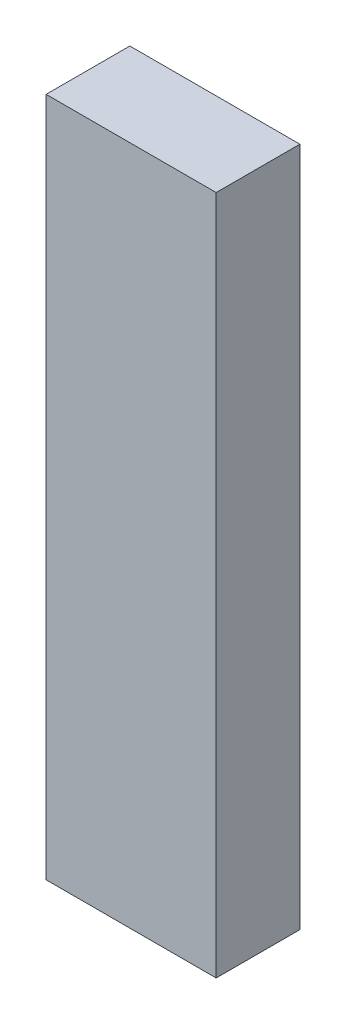
ISO-10303-21;
HEADER;
FILE_DESCRIPTION(('STEP AP214'),'2;1');
FILE_NAME('part.step','',(''),(''),'','','');
FILE_SCHEMA(('AUTOMOTIVE_DESIGN { 1 0 10303 214 1 1 1 1 }'));
ENDSEC;
DATA;
#1=APPLICATION_CONTEXT('core data for automotive mechanical design processes');
#2=APPLICATION_PROTOCOL_DEFINITION('international standard','automotive_design',2000,#1);
#3=PRODUCT_CONTEXT('',#1,'mechanical');
#4=PRODUCT('Part','Part','',(#3));
#5=PRODUCT_RELATED_PRODUCT_CATEGORY('part','',(#4));
#6=PRODUCT_DEFINITION_FORMATION('','',#4);
#7=PRODUCT_DEFINITION_CONTEXT('part definition',#1,'design');
#8=PRODUCT_DEFINITION('design','',#6,#7);
#9=PRODUCT_DEFINITION_SHAPE('','',#8);
#10=(LENGTH_UNIT() NAMED_UNIT(*) SI_UNIT(.MILLI.,.METRE.));
#11=(NAMED_UNIT(*) PLANE_ANGLE_UNIT() SI_UNIT($,.RADIAN.));
#12=(NAMED_UNIT(*) SI_UNIT($,.STERADIAN.) SOLID_ANGLE_UNIT());
#13=UNCERTAINTY_MEASURE_WITH_UNIT(LENGTH_MEASURE(1.E-05),#10,'distance_accuracy_value','');
#14=(GEOMETRIC_REPRESENTATION_CONTEXT(3) GLOBAL_UNCERTAINTY_ASSIGNED_CONTEXT((#13)) GLOBAL_UNIT_ASSIGNED_CONTEXT((#10,
#11,#12)) REPRESENTATION_CONTEXT('',''));
#15=CARTESIAN_POINT('',(0.,0.,0.));
#16=DIRECTION('',(0.,0.,1.));
#17=DIRECTION('',(1.,0.,0.));
#18=AXIS2_PLACEMENT_3D('',#15,#16,#17);
#19=CARTESIAN_POINT('',(-0.3250057,0.68579492,0.31999936));
#20=DIRECTION('',(0.,0.,-1.));
#21=DIRECTION('',(-1.,0.,0.));
#22=AXIS2_PLACEMENT_3D('',#19,#20,#21);
#23=PLANE('',#22);
#24=DIRECTION('',(0.,1.,0.));
#25=VECTOR('',#24,1.);
#26=CARTESIAN_POINT('',(0.32499554,-1.91420496,0.31999936));
#27=LINE('',#26,#25);
#28=CARTESIAN_POINT('',(0.32499554,-1.91420496,0.31999936));
#29=VERTEX_POINT('',#28);
#30=CARTESIAN_POINT('',(0.32499554,0.68579492,0.31999936));
#31=VERTEX_POINT('',#30);
#32=EDGE_CURVE('E79',#29,#31,#27,.T.);
#33=ORIENTED_EDGE('',*,*,#32,.T.);
#34=DIRECTION('',(1.,0.,0.));
#35=VECTOR('',#34,1.);
#36=CARTESIAN_POINT('',(0.32499554,0.68579492,0.31999936));
#37=LINE('',#36,#35);
#38=CARTESIAN_POINT('',(-0.3250057,0.68579492,0.31999936));
#39=VERTEX_POINT('',#38);
#40=EDGE_CURVE('E54',#31,#39,#37,.F.);
#41=ORIENTED_EDGE('',*,*,#40,.T.);
#42=DIRECTION('',(0.,1.,0.));
#43=VECTOR('',#42,1.);
#44=CARTESIAN_POINT('',(-0.3250057,0.68579492,0.31999936));
#45=LINE('',#44,#43);
#46=CARTESIAN_POINT('',(-0.3250057,-1.91420496,0.31999936));
#47=VERTEX_POINT('',#46);
#48=EDGE_CURVE('E56',#39,#47,#45,.F.);
#49=ORIENTED_EDGE('',*,*,#48,.T.);
#50=DIRECTION('',(1.,0.,0.));
#51=VECTOR('',#50,1.);
#52=CARTESIAN_POINT('',(-0.3250057,-1.91420496,0.31999936));
#53=LINE('',#52,#51);
#54=EDGE_CURVE('E19',#47,#29,#53,.T.);
#55=ORIENTED_EDGE('',*,*,#54,.T.);
#56=EDGE_LOOP('',(#33,#41,#49,#55));
#57=FACE_BOUND('',#56,.T.);
#58=ADVANCED_FACE('F16',(#57),#23,.F.);
#59=CARTESIAN_POINT('',(-0.3250057,-1.91420496,0.));
#60=DIRECTION('',(0.,1.,0.));
#61=DIRECTION('',(0.,0.,1.));
#62=AXIS2_PLACEMENT_3D('',#59,#60,#61);
#63=PLANE('',#62);
#64=ORIENTED_EDGE('',*,*,#54,.F.);
#65=DIRECTION('',(0.,0.,-1.));
#66=VECTOR('',#65,1.);
#67=CARTESIAN_POINT('',(-0.3250057,-1.91420496,0.));
#68=LINE('',#67,#66);
#69=CARTESIAN_POINT('',(-0.3250057,-1.91420496,0.));
#70=VERTEX_POINT('',#69);
#71=EDGE_CURVE('E62',#47,#70,#68,.T.);
#72=ORIENTED_EDGE('',*,*,#71,.T.);
#73=DIRECTION('',(-1.,0.,0.));
#74=VECTOR('',#73,1.);
#75=CARTESIAN_POINT('',(-0.3250057,-1.91420496,0.));
#76=LINE('',#75,#74);
#77=CARTESIAN_POINT('',(0.32499554,-1.91420496,0.));
#78=VERTEX_POINT('',#77);
#79=EDGE_CURVE('E82',#78,#70,#76,.T.);
#80=ORIENTED_EDGE('',*,*,#79,.F.);
#81=DIRECTION('',(0.,0.,1.));
#82=VECTOR('',#81,1.);
#83=CARTESIAN_POINT('',(0.32499554,-1.91420496,0.));
#84=LINE('',#83,#82);
#85=EDGE_CURVE('E67',#78,#29,#84,.T.);
#86=ORIENTED_EDGE('',*,*,#85,.T.);
#87=EDGE_LOOP('',(#64,#72,#80,#86));
#88=FACE_BOUND('',#87,.T.);
#89=ADVANCED_FACE('F64',(#88),#63,.F.);
#90=CARTESIAN_POINT('',(-0.3250057,0.68579492,0.));
#91=DIRECTION('',(1.,0.,0.));
#92=DIRECTION('',(0.,0.,-1.));
#93=AXIS2_PLACEMENT_3D('',#90,#91,#92);
#94=PLANE('',#93);
#95=ORIENTED_EDGE('',*,*,#48,.F.);
#96=DIRECTION('',(0.,0.,-1.));
#97=VECTOR('',#96,1.);
#98=CARTESIAN_POINT('',(-0.3250057,0.68579492,0.));
#99=LINE('',#98,#97);
#100=CARTESIAN_POINT('',(-0.3250057,0.68579492,0.));
#101=VERTEX_POINT('',#100);
#102=EDGE_CURVE('E74',#39,#101,#99,.T.);
#103=ORIENTED_EDGE('',*,*,#102,.T.);
#104=DIRECTION('',(0.,1.,0.));
#105=VECTOR('',#104,1.);
#106=CARTESIAN_POINT('',(-0.3250057,0.68579492,0.));
#107=LINE('',#106,#105);
#108=EDGE_CURVE('E71',#70,#101,#107,.T.);
#109=ORIENTED_EDGE('',*,*,#108,.F.);
#110=ORIENTED_EDGE('',*,*,#71,.F.);
#111=EDGE_LOOP('',(#95,#103,#109,#110));
#112=FACE_BOUND('',#111,.T.);
#113=ADVANCED_FACE('F69',(#112),#94,.F.);
#114=CARTESIAN_POINT('',(0.32499554,0.68579492,0.));
#115=DIRECTION('',(0.,-1.,0.));
#116=DIRECTION('',(0.,0.,-1.));
#117=AXIS2_PLACEMENT_3D('',#114,#115,#116);
#118=PLANE('',#117);
#119=ORIENTED_EDGE('',*,*,#40,.F.);
#120=DIRECTION('',(0.,0.,1.));
#121=VECTOR('',#120,1.);
#122=CARTESIAN_POINT('',(0.32499554,0.68579492,0.));
#123=LINE('',#122,#121);
#124=CARTESIAN_POINT('',(0.32499554,0.68579492,0.));
#125=VERTEX_POINT('',#124);
#126=EDGE_CURVE('E34',#31,#125,#123,.F.);
#127=ORIENTED_EDGE('',*,*,#126,.T.);
#128=DIRECTION('',(-1.,0.,0.));
#129=VECTOR('',#128,1.);
#130=CARTESIAN_POINT('',(-0.3250057,0.68579492,0.));
#131=LINE('',#130,#129);
#132=EDGE_CURVE('E25',#101,#125,#131,.F.);
#133=ORIENTED_EDGE('',*,*,#132,.F.);
#134=ORIENTED_EDGE('',*,*,#102,.F.);
#135=EDGE_LOOP('',(#119,#127,#133,#134));
#136=FACE_BOUND('',#135,.T.);
#137=ADVANCED_FACE('F88',(#136),#118,.F.);
#138=CARTESIAN_POINT('',(0.32499554,-1.91420496,0.));
#139=DIRECTION('',(-1.,0.,0.));
#140=DIRECTION('',(0.,0.,1.));
#141=AXIS2_PLACEMENT_3D('',#138,#139,#140);
#142=PLANE('',#141);
#143=ORIENTED_EDGE('',*,*,#32,.F.);
#144=ORIENTED_EDGE('',*,*,#85,.F.);
#145=DIRECTION('',(0.,1.,0.));
#146=VECTOR('',#145,1.);
#147=CARTESIAN_POINT('',(0.32499554,0.68579492,0.));
#148=LINE('',#147,#146);
#149=EDGE_CURVE('E10',#125,#78,#148,.F.);
#150=ORIENTED_EDGE('',*,*,#149,.F.);
#151=ORIENTED_EDGE('',*,*,#126,.F.);
#152=EDGE_LOOP('',(#143,#144,#150,#151));
#153=FACE_BOUND('',#152,.T.);
#154=ADVANCED_FACE('F90',(#153),#142,.F.);
#155=CARTESIAN_POINT('',(-0.3250057,0.68579492,0.));
#156=DIRECTION('',(0.,0.,-1.));
#157=DIRECTION('',(-1.,0.,0.));
#158=AXIS2_PLACEMENT_3D('',#155,#156,#157);
#159=PLANE('',#158);
#160=ORIENTED_EDGE('',*,*,#132,.T.);
#161=ORIENTED_EDGE('',*,*,#149,.T.);
#162=ORIENTED_EDGE('',*,*,#79,.T.);
#163=ORIENTED_EDGE('',*,*,#108,.T.);
#164=EDGE_LOOP('',(#160,#161,#162,#163));
#165=FACE_BOUND('',#164,.T.);
#166=ADVANCED_FACE('F87',(#165),#159,.T.);
#167=CLOSED_SHELL('',(#58,#89,#113,#137,#154,#166));
#168=MANIFOLD_SOLID_BREP('B1',#167);
#169=ADVANCED_BREP_SHAPE_REPRESENTATION('',(#18,#168),#14);
#170=SHAPE_DEFINITION_REPRESENTATION(#9,#169);
ENDSEC;
END-ISO-10303-21;
